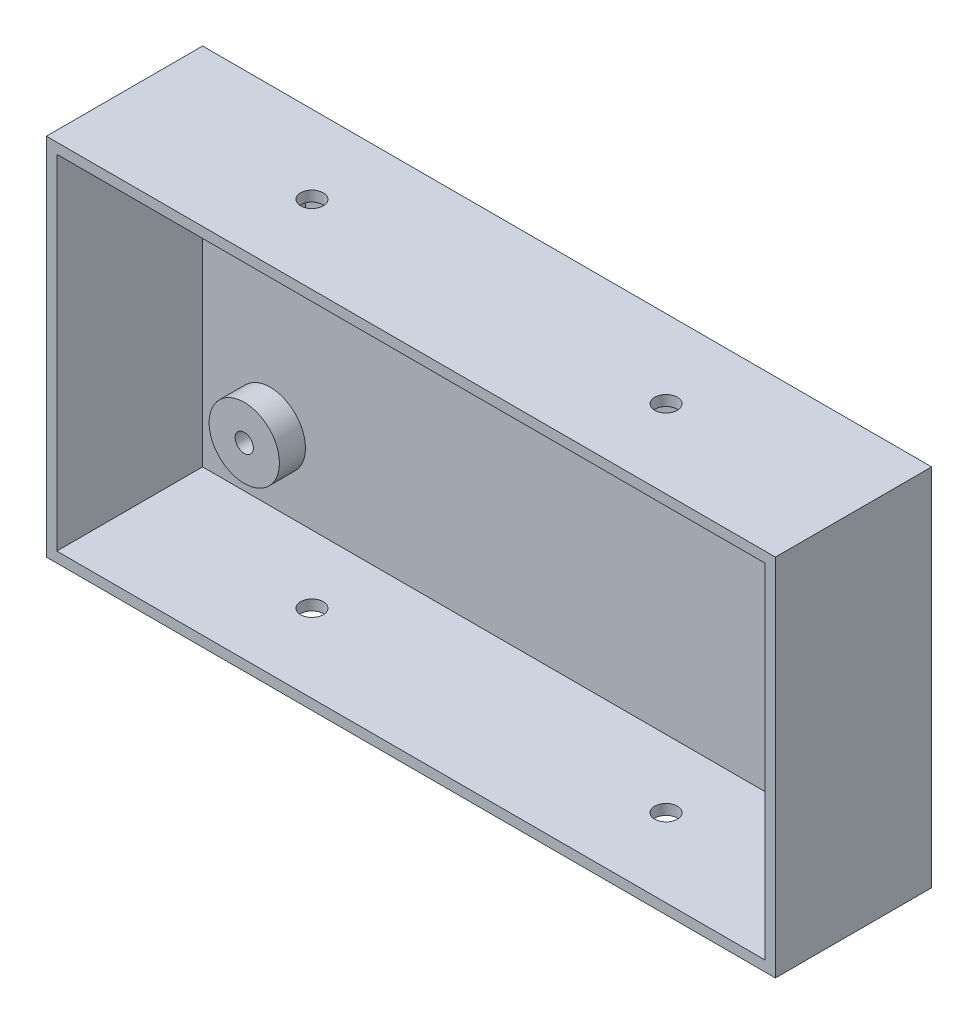
ISO-10303-21;
HEADER;
FILE_DESCRIPTION(('STEP AP214'),'2;1');
FILE_NAME('part.step','',(''),(''),'','','');
FILE_SCHEMA(('AUTOMOTIVE_DESIGN { 1 0 10303 214 1 1 1 1 }'));
ENDSEC;
DATA;
#1=APPLICATION_CONTEXT('core data for automotive mechanical design processes');
#2=APPLICATION_PROTOCOL_DEFINITION('international standard','automotive_design',2000,#1);
#3=PRODUCT_CONTEXT('',#1,'mechanical');
#4=PRODUCT('Part','Part','',(#3));
#5=PRODUCT_RELATED_PRODUCT_CATEGORY('part','',(#4));
#6=PRODUCT_DEFINITION_FORMATION('','',#4);
#7=PRODUCT_DEFINITION_CONTEXT('part definition',#1,'design');
#8=PRODUCT_DEFINITION('design','',#6,#7);
#9=PRODUCT_DEFINITION_SHAPE('','',#8);
#10=(LENGTH_UNIT() NAMED_UNIT(*) SI_UNIT(.MILLI.,.METRE.));
#11=(NAMED_UNIT(*) PLANE_ANGLE_UNIT() SI_UNIT($,.RADIAN.));
#12=(NAMED_UNIT(*) SI_UNIT($,.STERADIAN.) SOLID_ANGLE_UNIT());
#13=UNCERTAINTY_MEASURE_WITH_UNIT(LENGTH_MEASURE(1.E-05),#10,'distance_accuracy_value','');
#14=(GEOMETRIC_REPRESENTATION_CONTEXT(3) GLOBAL_UNCERTAINTY_ASSIGNED_CONTEXT((#13)) GLOBAL_UNIT_ASSIGNED_CONTEXT((#10,
#11,#12)) REPRESENTATION_CONTEXT('',''));
#15=CARTESIAN_POINT('',(0.,0.,0.));
#16=DIRECTION('',(0.,0.,1.));
#17=DIRECTION('',(1.,0.,0.));
#18=AXIS2_PLACEMENT_3D('',#15,#16,#17);
#19=CARTESIAN_POINT('',(0.,35.,30.));
#20=DIRECTION('',(0.,-1.,0.));
#21=DIRECTION('',(1.,0.,0.));
#22=AXIS2_PLACEMENT_3D('',#19,#20,#21);
#23=PLANE('',#22);
#24=DIRECTION('',(-1.,0.,0.));
#25=VECTOR('',#24,1.);
#26=CARTESIAN_POINT('',(0.,35.,0.));
#27=LINE('',#26,#25);
#28=CARTESIAN_POINT('',(70.,35.,0.));
#29=VERTEX_POINT('',#28);
#30=CARTESIAN_POINT('',(-70.,35.,0.));
#31=VERTEX_POINT('',#30);
#32=EDGE_CURVE('E165',#29,#31,#27,.T.);
#33=ORIENTED_EDGE('',*,*,#32,.T.);
#34=DIRECTION('',(0.,0.,-1.));
#35=VECTOR('',#34,1.);
#36=CARTESIAN_POINT('',(-70.,35.,30.));
#37=LINE('',#36,#35);
#38=CARTESIAN_POINT('',(-70.,35.,30.));
#39=VERTEX_POINT('',#38);
#40=EDGE_CURVE('E204',#39,#31,#37,.T.);
#41=ORIENTED_EDGE('',*,*,#40,.F.);
#42=DIRECTION('',(-1.,0.,0.));
#43=VECTOR('',#42,1.);
#44=CARTESIAN_POINT('',(0.,35.,30.));
#45=LINE('',#44,#43);
#46=CARTESIAN_POINT('',(70.,35.,30.));
#47=VERTEX_POINT('',#46);
#48=EDGE_CURVE('E173',#47,#39,#45,.T.);
#49=ORIENTED_EDGE('',*,*,#48,.F.);
#50=DIRECTION('',(0.,0.,-1.));
#51=VECTOR('',#50,1.);
#52=CARTESIAN_POINT('',(70.,35.,30.));
#53=LINE('',#52,#51);
#54=EDGE_CURVE('E183',#47,#29,#53,.T.);
#55=ORIENTED_EDGE('',*,*,#54,.T.);
#56=EDGE_LOOP('',(#33,#41,#49,#55));
#57=FACE_BOUND('',#56,.T.);
#58=CARTESIAN_POINT('',(-34.,35.,15.));
#59=DIRECTION('',(0.,-1.,0.));
#60=DIRECTION('',(-1.,0.,0.));
#61=AXIS2_PLACEMENT_3D('',#58,#59,#60);
#62=CIRCLE('',#61,2.175);
#63=CARTESIAN_POINT('',(-36.175,35.,15.));
#64=VERTEX_POINT('',#63);
#65=EDGE_CURVE('E261',#64,#64,#62,.T.);
#66=ORIENTED_EDGE('',*,*,#65,.T.);
#67=EDGE_LOOP('',(#66));
#68=FACE_BOUND('',#67,.T.);
#69=CARTESIAN_POINT('',(34.,35.,15.));
#70=DIRECTION('',(0.,1.,0.));
#71=DIRECTION('',(-1.,0.,0.));
#72=AXIS2_PLACEMENT_3D('',#69,#70,#71);
#73=CIRCLE('',#72,2.175);
#74=CARTESIAN_POINT('',(31.825,35.,15.));
#75=VERTEX_POINT('',#74);
#76=EDGE_CURVE('E264',#75,#75,#73,.T.);
#77=ORIENTED_EDGE('',*,*,#76,.F.);
#78=EDGE_LOOP('',(#77));
#79=FACE_BOUND('',#78,.T.);
#80=ADVANCED_FACE('F16',(#57,#68,#79),#23,.F.);
#81=CARTESIAN_POINT('',(0.,33.,-227.817621135332));
#82=DIRECTION('',(0.,1.,0.));
#83=DIRECTION('',(-1.,0.,0.));
#84=AXIS2_PLACEMENT_3D('',#81,#82,#83);
#85=PLANE('',#84);
#86=DIRECTION('',(1.,0.,0.));
#87=VECTOR('',#86,1.);
#88=CARTESIAN_POINT('',(0.,33.,2.));
#89=LINE('',#88,#87);
#90=CARTESIAN_POINT('',(-68.,33.,2.));
#91=VERTEX_POINT('',#90);
#92=CARTESIAN_POINT('',(68.,33.,2.));
#93=VERTEX_POINT('',#92);
#94=EDGE_CURVE('E127',#91,#93,#89,.T.);
#95=ORIENTED_EDGE('',*,*,#94,.T.);
#96=DIRECTION('',(0.,0.,1.));
#97=VECTOR('',#96,1.);
#98=CARTESIAN_POINT('',(68.,33.,-227.817621135332));
#99=LINE('',#98,#97);
#100=CARTESIAN_POINT('',(68.,33.,30.));
#101=VERTEX_POINT('',#100);
#102=EDGE_CURVE('E135',#93,#101,#99,.T.);
#103=ORIENTED_EDGE('',*,*,#102,.T.);
#104=DIRECTION('',(-1.,0.,0.));
#105=VECTOR('',#104,1.);
#106=CARTESIAN_POINT('',(0.,33.,30.));
#107=LINE('',#106,#105);
#108=CARTESIAN_POINT('',(-68.,33.,30.));
#109=VERTEX_POINT('',#108);
#110=EDGE_CURVE('E131',#101,#109,#107,.T.);
#111=ORIENTED_EDGE('',*,*,#110,.T.);
#112=DIRECTION('',(0.,0.,1.));
#113=VECTOR('',#112,1.);
#114=CARTESIAN_POINT('',(-68.,33.,-227.817621135332));
#115=LINE('',#114,#113);
#116=EDGE_CURVE('E116',#91,#109,#115,.T.);
#117=ORIENTED_EDGE('',*,*,#116,.F.);
#118=EDGE_LOOP('',(#95,#103,#111,#117));
#119=FACE_BOUND('',#118,.T.);
#120=CARTESIAN_POINT('',(-34.,33.,15.));
#121=DIRECTION('',(0.,-1.,0.));
#122=DIRECTION('',(-1.,0.,0.));
#123=AXIS2_PLACEMENT_3D('',#120,#121,#122);
#124=CIRCLE('',#123,2.175);
#125=CARTESIAN_POINT('',(-36.175,33.,15.));
#126=VERTEX_POINT('',#125);
#127=EDGE_CURVE('E268',#126,#126,#124,.T.);
#128=ORIENTED_EDGE('',*,*,#127,.F.);
#129=EDGE_LOOP('',(#128));
#130=FACE_BOUND('',#129,.T.);
#131=CARTESIAN_POINT('',(34.,33.,15.));
#132=DIRECTION('',(0.,1.,0.));
#133=DIRECTION('',(-1.,0.,0.));
#134=AXIS2_PLACEMENT_3D('',#131,#132,#133);
#135=CIRCLE('',#134,2.175);
#136=CARTESIAN_POINT('',(31.825,33.,15.));
#137=VERTEX_POINT('',#136);
#138=EDGE_CURVE('E267',#137,#137,#135,.T.);
#139=ORIENTED_EDGE('',*,*,#138,.T.);
#140=EDGE_LOOP('',(#139));
#141=FACE_BOUND('',#140,.T.);
#142=ADVANCED_FACE('F132',(#119,#130,#141),#85,.F.);
#143=CARTESIAN_POINT('',(0.,-35.,30.));
#144=DIRECTION('',(0.,1.,0.));
#145=DIRECTION('',(-1.,0.,0.));
#146=AXIS2_PLACEMENT_3D('',#143,#144,#145);
#147=PLANE('',#146);
#148=DIRECTION('',(1.,0.,0.));
#149=VECTOR('',#148,1.);
#150=CARTESIAN_POINT('',(0.,-35.,0.));
#151=LINE('',#150,#149);
#152=CARTESIAN_POINT('',(-70.,-35.,0.));
#153=VERTEX_POINT('',#152);
#154=CARTESIAN_POINT('',(70.,-35.,0.));
#155=VERTEX_POINT('',#154);
#156=EDGE_CURVE('E190',#153,#155,#151,.T.);
#157=ORIENTED_EDGE('',*,*,#156,.T.);
#158=DIRECTION('',(0.,0.,-1.));
#159=VECTOR('',#158,1.);
#160=CARTESIAN_POINT('',(70.,-35.,30.));
#161=LINE('',#160,#159);
#162=CARTESIAN_POINT('',(70.,-35.,30.));
#163=VERTEX_POINT('',#162);
#164=EDGE_CURVE('E197',#163,#155,#161,.T.);
#165=ORIENTED_EDGE('',*,*,#164,.F.);
#166=DIRECTION('',(1.,0.,0.));
#167=VECTOR('',#166,1.);
#168=CARTESIAN_POINT('',(0.,-35.,30.));
#169=LINE('',#168,#167);
#170=CARTESIAN_POINT('',(-70.,-35.,30.));
#171=VERTEX_POINT('',#170);
#172=EDGE_CURVE('E178',#171,#163,#169,.T.);
#173=ORIENTED_EDGE('',*,*,#172,.F.);
#174=DIRECTION('',(0.,0.,-1.));
#175=VECTOR('',#174,1.);
#176=CARTESIAN_POINT('',(-70.,-35.,30.));
#177=LINE('',#176,#175);
#178=EDGE_CURVE('E200',#171,#153,#177,.T.);
#179=ORIENTED_EDGE('',*,*,#178,.T.);
#180=EDGE_LOOP('',(#157,#165,#173,#179));
#181=FACE_BOUND('',#180,.T.);
#182=CARTESIAN_POINT('',(34.,-35.,15.));
#183=DIRECTION('',(0.,1.,0.));
#184=DIRECTION('',(1.,0.,0.));
#185=AXIS2_PLACEMENT_3D('',#182,#183,#184);
#186=CIRCLE('',#185,2.175);
#187=CARTESIAN_POINT('',(36.175,-35.,15.));
#188=VERTEX_POINT('',#187);
#189=EDGE_CURVE('E274',#188,#188,#186,.T.);
#190=ORIENTED_EDGE('',*,*,#189,.T.);
#191=EDGE_LOOP('',(#190));
#192=FACE_BOUND('',#191,.T.);
#193=CARTESIAN_POINT('',(-34.,-35.,15.));
#194=DIRECTION('',(0.,-1.,0.));
#195=DIRECTION('',(1.,0.,0.));
#196=AXIS2_PLACEMENT_3D('',#193,#194,#195);
#197=CIRCLE('',#196,2.175);
#198=CARTESIAN_POINT('',(-31.825,-35.,15.));
#199=VERTEX_POINT('',#198);
#200=EDGE_CURVE('E287',#199,#199,#197,.T.);
#201=ORIENTED_EDGE('',*,*,#200,.F.);
#202=EDGE_LOOP('',(#201));
#203=FACE_BOUND('',#202,.T.);
#204=ADVANCED_FACE('F235',(#181,#192,#203),#147,.F.);
#205=CARTESIAN_POINT('',(0.,-33.,-227.817621135332));
#206=DIRECTION('',(0.,-1.,0.));
#207=DIRECTION('',(1.,0.,0.));
#208=AXIS2_PLACEMENT_3D('',#205,#206,#207);
#209=PLANE('',#208);
#210=DIRECTION('',(-1.,0.,0.));
#211=VECTOR('',#210,1.);
#212=CARTESIAN_POINT('',(0.,-33.,2.));
#213=LINE('',#212,#211);
#214=CARTESIAN_POINT('',(68.,-33.,2.));
#215=VERTEX_POINT('',#214);
#216=CARTESIAN_POINT('',(-68.,-33.,2.));
#217=VERTEX_POINT('',#216);
#218=EDGE_CURVE('E166',#215,#217,#213,.T.);
#219=ORIENTED_EDGE('',*,*,#218,.T.);
#220=DIRECTION('',(0.,0.,1.));
#221=VECTOR('',#220,1.);
#222=CARTESIAN_POINT('',(-68.,-33.,-227.817621135332));
#223=LINE('',#222,#221);
#224=CARTESIAN_POINT('',(-68.,-33.,30.));
#225=VERTEX_POINT('',#224);
#226=EDGE_CURVE('E128',#217,#225,#223,.T.);
#227=ORIENTED_EDGE('',*,*,#226,.T.);
#228=DIRECTION('',(1.,0.,0.));
#229=VECTOR('',#228,1.);
#230=CARTESIAN_POINT('',(0.,-33.,30.));
#231=LINE('',#230,#229);
#232=CARTESIAN_POINT('',(68.,-33.,30.));
#233=VERTEX_POINT('',#232);
#234=EDGE_CURVE('E36',#225,#233,#231,.T.);
#235=ORIENTED_EDGE('',*,*,#234,.T.);
#236=DIRECTION('',(0.,0.,1.));
#237=VECTOR('',#236,1.);
#238=CARTESIAN_POINT('',(68.,-33.,-227.817621135332));
#239=LINE('',#238,#237);
#240=EDGE_CURVE('E156',#215,#233,#239,.T.);
#241=ORIENTED_EDGE('',*,*,#240,.F.);
#242=EDGE_LOOP('',(#219,#227,#235,#241));
#243=FACE_BOUND('',#242,.T.);
#244=CARTESIAN_POINT('',(34.,-33.,15.));
#245=DIRECTION('',(0.,1.,0.));
#246=DIRECTION('',(1.,0.,0.));
#247=AXIS2_PLACEMENT_3D('',#244,#245,#246);
#248=CIRCLE('',#247,2.175);
#249=CARTESIAN_POINT('',(36.175,-33.,15.));
#250=VERTEX_POINT('',#249);
#251=EDGE_CURVE('E291',#250,#250,#248,.T.);
#252=ORIENTED_EDGE('',*,*,#251,.F.);
#253=EDGE_LOOP('',(#252));
#254=FACE_BOUND('',#253,.T.);
#255=CARTESIAN_POINT('',(-34.,-33.,15.));
#256=DIRECTION('',(0.,-1.,0.));
#257=DIRECTION('',(1.,0.,0.));
#258=AXIS2_PLACEMENT_3D('',#255,#256,#257);
#259=CIRCLE('',#258,2.175);
#260=CARTESIAN_POINT('',(-31.825,-33.,15.));
#261=VERTEX_POINT('',#260);
#262=EDGE_CURVE('E282',#261,#261,#259,.T.);
#263=ORIENTED_EDGE('',*,*,#262,.T.);
#264=EDGE_LOOP('',(#263));
#265=FACE_BOUND('',#264,.T.);
#266=ADVANCED_FACE('F224',(#243,#254,#265),#209,.F.);
#267=CARTESIAN_POINT('',(0.,0.,2.));
#268=DIRECTION('',(0.,0.,1.));
#269=DIRECTION('',(1.,0.,0.));
#270=AXIS2_PLACEMENT_3D('',#267,#268,#269);
#271=PLANE('',#270);
#272=CARTESIAN_POINT('',(55.,-20.,2.));
#273=DIRECTION('',(0.,0.,1.));
#274=DIRECTION('',(1.,0.,0.));
#275=AXIS2_PLACEMENT_3D('',#272,#273,#274);
#276=CIRCLE('',#275,6.75);
#277=CARTESIAN_POINT('',(61.75,-20.,2.));
#278=VERTEX_POINT('',#277);
#279=EDGE_CURVE('E286',#278,#278,#276,.T.);
#280=ORIENTED_EDGE('',*,*,#279,.F.);
#281=EDGE_LOOP('',(#280));
#282=FACE_BOUND('',#281,.T.);
#283=CARTESIAN_POINT('',(55.,20.,2.));
#284=DIRECTION('',(0.,0.,1.));
#285=DIRECTION('',(1.,0.,0.));
#286=AXIS2_PLACEMENT_3D('',#283,#284,#285);
#287=CIRCLE('',#286,6.75);
#288=CARTESIAN_POINT('',(61.75,20.,2.));
#289=VERTEX_POINT('',#288);
#290=EDGE_CURVE('E10',#289,#289,#287,.T.);
#291=ORIENTED_EDGE('',*,*,#290,.F.);
#292=EDGE_LOOP('',(#291));
#293=FACE_BOUND('',#292,.T.);
#294=ORIENTED_EDGE('',*,*,#94,.F.);
#295=DIRECTION('',(0.,1.,0.));
#296=VECTOR('',#295,1.);
#297=CARTESIAN_POINT('',(-68.,0.,2.));
#298=LINE('',#297,#296);
#299=EDGE_CURVE('E122',#217,#91,#298,.T.);
#300=ORIENTED_EDGE('',*,*,#299,.F.);
#301=ORIENTED_EDGE('',*,*,#218,.F.);
#302=DIRECTION('',(0.,-1.,0.));
#303=VECTOR('',#302,1.);
#304=CARTESIAN_POINT('',(68.,0.,2.));
#305=LINE('',#304,#303);
#306=EDGE_CURVE('E161',#93,#215,#305,.T.);
#307=ORIENTED_EDGE('',*,*,#306,.F.);
#308=EDGE_LOOP('',(#294,#300,#301,#307));
#309=FACE_BOUND('',#308,.T.);
#310=CARTESIAN_POINT('',(-55.,20.,2.));
#311=DIRECTION('',(0.,0.,1.));
#312=DIRECTION('',(1.,0.,0.));
#313=AXIS2_PLACEMENT_3D('',#310,#311,#312);
#314=CIRCLE('',#313,6.75);
#315=CARTESIAN_POINT('',(-48.25,20.,2.));
#316=VERTEX_POINT('',#315);
#317=EDGE_CURVE('E333',#316,#316,#314,.T.);
#318=ORIENTED_EDGE('',*,*,#317,.F.);
#319=EDGE_LOOP('',(#318));
#320=FACE_BOUND('',#319,.T.);
#321=CARTESIAN_POINT('',(-55.,-20.,2.));
#322=DIRECTION('',(0.,0.,1.));
#323=DIRECTION('',(1.,0.,0.));
#324=AXIS2_PLACEMENT_3D('',#321,#322,#323);
#325=CIRCLE('',#324,6.75);
#326=CARTESIAN_POINT('',(-48.25,-20.,2.));
#327=VERTEX_POINT('',#326);
#328=EDGE_CURVE('E24',#327,#327,#325,.T.);
#329=ORIENTED_EDGE('',*,*,#328,.F.);
#330=EDGE_LOOP('',(#329));
#331=FACE_BOUND('',#330,.T.);
#332=ADVANCED_FACE('F221',(#282,#293,#309,#320,#331),#271,.T.);
#333=CARTESIAN_POINT('',(-70.,0.,30.));
#334=DIRECTION('',(1.,0.,0.));
#335=DIRECTION('',(0.,0.,-1.));
#336=AXIS2_PLACEMENT_3D('',#333,#334,#335);
#337=PLANE('',#336);
#338=DIRECTION('',(0.,-1.,0.));
#339=VECTOR('',#338,1.);
#340=CARTESIAN_POINT('',(-70.,0.,0.));
#341=LINE('',#340,#339);
#342=EDGE_CURVE('E187',#31,#153,#341,.T.);
#343=ORIENTED_EDGE('',*,*,#342,.T.);
#344=ORIENTED_EDGE('',*,*,#178,.F.);
#345=DIRECTION('',(0.,-1.,0.));
#346=VECTOR('',#345,1.);
#347=CARTESIAN_POINT('',(-70.,0.,30.));
#348=LINE('',#347,#346);
#349=EDGE_CURVE('E85',#39,#171,#348,.T.);
#350=ORIENTED_EDGE('',*,*,#349,.F.);
#351=ORIENTED_EDGE('',*,*,#40,.T.);
#352=EDGE_LOOP('',(#343,#344,#350,#351));
#353=FACE_BOUND('',#352,.T.);
#354=ADVANCED_FACE('F223',(#353),#337,.F.);
#355=CARTESIAN_POINT('',(70.,0.,30.));
#356=DIRECTION('',(-1.,0.,0.));
#357=DIRECTION('',(0.,0.,1.));
#358=AXIS2_PLACEMENT_3D('',#355,#356,#357);
#359=PLANE('',#358);
#360=DIRECTION('',(0.,1.,0.));
#361=VECTOR('',#360,1.);
#362=CARTESIAN_POINT('',(70.,0.,0.));
#363=LINE('',#362,#361);
#364=EDGE_CURVE('E75',#155,#29,#363,.T.);
#365=ORIENTED_EDGE('',*,*,#364,.T.);
#366=ORIENTED_EDGE('',*,*,#54,.F.);
#367=DIRECTION('',(0.,1.,0.));
#368=VECTOR('',#367,1.);
#369=CARTESIAN_POINT('',(70.,0.,30.));
#370=LINE('',#369,#368);
#371=EDGE_CURVE('E49',#163,#47,#370,.T.);
#372=ORIENTED_EDGE('',*,*,#371,.F.);
#373=ORIENTED_EDGE('',*,*,#164,.T.);
#374=EDGE_LOOP('',(#365,#366,#372,#373));
#375=FACE_BOUND('',#374,.T.);
#376=ADVANCED_FACE('F234',(#375),#359,.F.);
#377=CARTESIAN_POINT('',(0.,0.,30.));
#378=DIRECTION('',(0.,0.,1.));
#379=DIRECTION('',(1.,0.,0.));
#380=AXIS2_PLACEMENT_3D('',#377,#378,#379);
#381=PLANE('',#380);
#382=ORIENTED_EDGE('',*,*,#110,.F.);
#383=DIRECTION('',(0.,1.,0.));
#384=VECTOR('',#383,1.);
#385=CARTESIAN_POINT('',(68.,0.,30.));
#386=LINE('',#385,#384);
#387=EDGE_CURVE('E149',#233,#101,#386,.T.);
#388=ORIENTED_EDGE('',*,*,#387,.F.);
#389=ORIENTED_EDGE('',*,*,#234,.F.);
#390=DIRECTION('',(0.,-1.,0.));
#391=VECTOR('',#390,1.);
#392=CARTESIAN_POINT('',(-68.,0.,30.));
#393=LINE('',#392,#391);
#394=EDGE_CURVE('E121',#109,#225,#393,.T.);
#395=ORIENTED_EDGE('',*,*,#394,.F.);
#396=EDGE_LOOP('',(#382,#388,#389,#395));
#397=FACE_BOUND('',#396,.T.);
#398=ORIENTED_EDGE('',*,*,#48,.T.);
#399=ORIENTED_EDGE('',*,*,#349,.T.);
#400=ORIENTED_EDGE('',*,*,#172,.T.);
#401=ORIENTED_EDGE('',*,*,#371,.T.);
#402=EDGE_LOOP('',(#398,#399,#400,#401));
#403=FACE_BOUND('',#402,.T.);
#404=ADVANCED_FACE('F142',(#397,#403),#381,.T.);
#405=CARTESIAN_POINT('',(0.,0.,0.));
#406=DIRECTION('',(0.,0.,1.));
#407=DIRECTION('',(1.,0.,0.));
#408=AXIS2_PLACEMENT_3D('',#405,#406,#407);
#409=PLANE('',#408);
#410=ORIENTED_EDGE('',*,*,#32,.F.);
#411=ORIENTED_EDGE('',*,*,#364,.F.);
#412=ORIENTED_EDGE('',*,*,#156,.F.);
#413=ORIENTED_EDGE('',*,*,#342,.F.);
#414=EDGE_LOOP('',(#410,#411,#412,#413));
#415=FACE_BOUND('',#414,.T.);
#416=ADVANCED_FACE('F364',(#415),#409,.F.);
#417=CARTESIAN_POINT('',(-68.,0.,-227.817621135332));
#418=DIRECTION('',(-1.,0.,0.));
#419=DIRECTION('',(0.,0.,1.));
#420=AXIS2_PLACEMENT_3D('',#417,#418,#419);
#421=PLANE('',#420);
#422=ORIENTED_EDGE('',*,*,#299,.T.);
#423=ORIENTED_EDGE('',*,*,#116,.T.);
#424=ORIENTED_EDGE('',*,*,#394,.T.);
#425=ORIENTED_EDGE('',*,*,#226,.F.);
#426=EDGE_LOOP('',(#422,#423,#424,#425));
#427=FACE_BOUND('',#426,.T.);
#428=ADVANCED_FACE('F118',(#427),#421,.F.);
#429=CARTESIAN_POINT('',(68.,0.,-227.817621135332));
#430=DIRECTION('',(1.,0.,0.));
#431=DIRECTION('',(0.,0.,-1.));
#432=AXIS2_PLACEMENT_3D('',#429,#430,#431);
#433=PLANE('',#432);
#434=ORIENTED_EDGE('',*,*,#306,.T.);
#435=ORIENTED_EDGE('',*,*,#240,.T.);
#436=ORIENTED_EDGE('',*,*,#387,.T.);
#437=ORIENTED_EDGE('',*,*,#102,.F.);
#438=EDGE_LOOP('',(#434,#435,#436,#437));
#439=FACE_BOUND('',#438,.T.);
#440=ADVANCED_FACE('F357',(#439),#433,.F.);
#441=CARTESIAN_POINT('',(-55.,20.,7.));
#442=DIRECTION('',(0.,0.,-1.));
#443=DIRECTION('',(-1.,0.,0.));
#444=AXIS2_PLACEMENT_3D('',#441,#442,#443);
#445=CYLINDRICAL_SURFACE('',#444,1.75);
#446=CARTESIAN_POINT('',(-55.,20.,7.));
#447=DIRECTION('',(0.,0.,1.));
#448=DIRECTION('',(1.,0.,0.));
#449=AXIS2_PLACEMENT_3D('',#446,#447,#448);
#450=CIRCLE('',#449,1.75);
#451=CARTESIAN_POINT('',(-53.25,20.,7.));
#452=VERTEX_POINT('',#451);
#453=EDGE_CURVE('E140',#452,#452,#450,.T.);
#454=ORIENTED_EDGE('',*,*,#453,.T.);
#455=EDGE_LOOP('',(#454));
#456=FACE_BOUND('',#455,.T.);
#457=CARTESIAN_POINT('',(-55.,20.,2.));
#458=DIRECTION('',(0.,0.,1.));
#459=DIRECTION('',(1.,0.,0.));
#460=AXIS2_PLACEMENT_3D('',#457,#458,#459);
#461=CIRCLE('',#460,1.75);
#462=CARTESIAN_POINT('',(-53.25,20.,2.));
#463=VERTEX_POINT('',#462);
#464=EDGE_CURVE('E206',#463,#463,#461,.F.);
#465=ORIENTED_EDGE('',*,*,#464,.T.);
#466=EDGE_LOOP('',(#465));
#467=FACE_BOUND('',#466,.T.);
#468=ADVANCED_FACE('F348',(#456,#467),#445,.F.);
#469=CARTESIAN_POINT('',(-55.,20.,7.));
#470=DIRECTION('',(0.,0.,-1.));
#471=DIRECTION('',(-1.,0.,0.));
#472=AXIS2_PLACEMENT_3D('',#469,#470,#471);
#473=CYLINDRICAL_SURFACE('',#472,6.75);
#474=CARTESIAN_POINT('',(-55.,20.,7.));
#475=DIRECTION('',(0.,0.,1.));
#476=DIRECTION('',(1.,0.,0.));
#477=AXIS2_PLACEMENT_3D('',#474,#475,#476);
#478=CIRCLE('',#477,6.75);
#479=CARTESIAN_POINT('',(-48.25,20.,7.));
#480=VERTEX_POINT('',#479);
#481=EDGE_CURVE('E334',#480,#480,#478,.T.);
#482=ORIENTED_EDGE('',*,*,#481,.F.);
#483=EDGE_LOOP('',(#482));
#484=FACE_BOUND('',#483,.T.);
#485=ORIENTED_EDGE('',*,*,#317,.T.);
#486=EDGE_LOOP('',(#485));
#487=FACE_BOUND('',#486,.T.);
#488=ADVANCED_FACE('F345',(#484,#487),#473,.T.);
#489=CARTESIAN_POINT('',(0.,0.,7.));
#490=DIRECTION('',(0.,0.,1.));
#491=DIRECTION('',(1.,0.,0.));
#492=AXIS2_PLACEMENT_3D('',#489,#490,#491);
#493=PLANE('',#492);
#494=ORIENTED_EDGE('',*,*,#453,.F.);
#495=EDGE_LOOP('',(#494));
#496=FACE_BOUND('',#495,.T.);
#497=ORIENTED_EDGE('',*,*,#481,.T.);
#498=EDGE_LOOP('',(#497));
#499=FACE_BOUND('',#498,.T.);
#500=ADVANCED_FACE('F247',(#496,#499),#493,.T.);
#501=ORIENTED_EDGE('',*,*,#464,.F.);
#502=EDGE_LOOP('',(#501));
#503=FACE_BOUND('',#502,.T.);
#504=ADVANCED_FACE('F228',(#503),#271,.T.);
#505=CARTESIAN_POINT('',(-55.,-20.,7.));
#506=DIRECTION('',(0.,0.,-1.));
#507=DIRECTION('',(-1.,0.,0.));
#508=AXIS2_PLACEMENT_3D('',#505,#506,#507);
#509=CYLINDRICAL_SURFACE('',#508,6.75);
#510=CARTESIAN_POINT('',(-55.,-20.,7.));
#511=DIRECTION('',(0.,0.,-1.));
#512=DIRECTION('',(1.,0.,0.));
#513=AXIS2_PLACEMENT_3D('',#510,#511,#512);
#514=CIRCLE('',#513,6.75);
#515=CARTESIAN_POINT('',(-48.25,-20.,7.));
#516=VERTEX_POINT('',#515);
#517=EDGE_CURVE('E322',#516,#516,#514,.T.);
#518=ORIENTED_EDGE('',*,*,#517,.T.);
#519=EDGE_LOOP('',(#518));
#520=FACE_BOUND('',#519,.T.);
#521=ORIENTED_EDGE('',*,*,#328,.T.);
#522=EDGE_LOOP('',(#521));
#523=FACE_BOUND('',#522,.T.);
#524=ADVANCED_FACE('F219',(#520,#523),#509,.T.);
#525=CARTESIAN_POINT('',(-55.,-20.,7.));
#526=DIRECTION('',(0.,0.,-1.));
#527=DIRECTION('',(-1.,0.,0.));
#528=AXIS2_PLACEMENT_3D('',#525,#526,#527);
#529=CYLINDRICAL_SURFACE('',#528,1.75);
#530=CARTESIAN_POINT('',(-55.,-20.,7.));
#531=DIRECTION('',(0.,0.,1.));
#532=DIRECTION('',(1.,0.,0.));
#533=AXIS2_PLACEMENT_3D('',#530,#531,#532);
#534=CIRCLE('',#533,1.75);
#535=CARTESIAN_POINT('',(-53.25,-20.,7.));
#536=VERTEX_POINT('',#535);
#537=EDGE_CURVE('E329',#536,#536,#534,.T.);
#538=ORIENTED_EDGE('',*,*,#537,.T.);
#539=EDGE_LOOP('',(#538));
#540=FACE_BOUND('',#539,.T.);
#541=CARTESIAN_POINT('',(-55.,-20.,2.));
#542=DIRECTION('',(0.,0.,1.));
#543=DIRECTION('',(1.,0.,0.));
#544=AXIS2_PLACEMENT_3D('',#541,#542,#543);
#545=CIRCLE('',#544,1.75);
#546=CARTESIAN_POINT('',(-53.25,-20.,2.));
#547=VERTEX_POINT('',#546);
#548=EDGE_CURVE('E210',#547,#547,#545,.F.);
#549=ORIENTED_EDGE('',*,*,#548,.T.);
#550=EDGE_LOOP('',(#549));
#551=FACE_BOUND('',#550,.T.);
#552=ADVANCED_FACE('F432',(#540,#551),#529,.F.);
#553=CARTESIAN_POINT('',(0.,0.,7.));
#554=DIRECTION('',(0.,0.,1.));
#555=DIRECTION('',(1.,0.,0.));
#556=AXIS2_PLACEMENT_3D('',#553,#554,#555);
#557=PLANE('',#556);
#558=ORIENTED_EDGE('',*,*,#517,.F.);
#559=EDGE_LOOP('',(#558));
#560=FACE_BOUND('',#559,.T.);
#561=ORIENTED_EDGE('',*,*,#537,.F.);
#562=EDGE_LOOP('',(#561));
#563=FACE_BOUND('',#562,.T.);
#564=ADVANCED_FACE('F429',(#560,#563),#557,.T.);
#565=ORIENTED_EDGE('',*,*,#548,.F.);
#566=EDGE_LOOP('',(#565));
#567=FACE_BOUND('',#566,.T.);
#568=ADVANCED_FACE('F249',(#567),#271,.T.);
#569=CARTESIAN_POINT('',(55.,20.,7.));
#570=DIRECTION('',(0.,0.,-1.));
#571=DIRECTION('',(-1.,0.,0.));
#572=AXIS2_PLACEMENT_3D('',#569,#570,#571);
#573=CYLINDRICAL_SURFACE('',#572,6.75);
#574=CARTESIAN_POINT('',(55.,20.,7.));
#575=DIRECTION('',(0.,0.,-1.));
#576=DIRECTION('',(1.,0.,0.));
#577=AXIS2_PLACEMENT_3D('',#574,#575,#576);
#578=CIRCLE('',#577,6.75);
#579=CARTESIAN_POINT('',(61.75,20.,7.));
#580=VERTEX_POINT('',#579);
#581=EDGE_CURVE('E318',#580,#580,#578,.T.);
#582=ORIENTED_EDGE('',*,*,#581,.T.);
#583=EDGE_LOOP('',(#582));
#584=FACE_BOUND('',#583,.T.);
#585=ORIENTED_EDGE('',*,*,#290,.T.);
#586=EDGE_LOOP('',(#585));
#587=FACE_BOUND('',#586,.T.);
#588=ADVANCED_FACE('F422',(#584,#587),#573,.T.);
#589=CARTESIAN_POINT('',(55.,20.,7.));
#590=DIRECTION('',(0.,0.,-1.));
#591=DIRECTION('',(-1.,0.,0.));
#592=AXIS2_PLACEMENT_3D('',#589,#590,#591);
#593=CYLINDRICAL_SURFACE('',#592,1.75);
#594=CARTESIAN_POINT('',(55.,20.,7.));
#595=DIRECTION('',(0.,0.,-1.));
#596=DIRECTION('',(1.,0.,0.));
#597=AXIS2_PLACEMENT_3D('',#594,#595,#596);
#598=CIRCLE('',#597,1.75);
#599=CARTESIAN_POINT('',(56.75,20.,7.));
#600=VERTEX_POINT('',#599);
#601=EDGE_CURVE('E314',#600,#600,#598,.T.);
#602=ORIENTED_EDGE('',*,*,#601,.F.);
#603=EDGE_LOOP('',(#602));
#604=FACE_BOUND('',#603,.T.);
#605=CARTESIAN_POINT('',(55.,20.,2.));
#606=DIRECTION('',(0.,0.,-1.));
#607=DIRECTION('',(1.,0.,0.));
#608=AXIS2_PLACEMENT_3D('',#605,#606,#607);
#609=CIRCLE('',#608,1.75);
#610=CARTESIAN_POINT('',(56.75,20.,2.));
#611=VERTEX_POINT('',#610);
#612=EDGE_CURVE('E307',#611,#611,#609,.T.);
#613=ORIENTED_EDGE('',*,*,#612,.T.);
#614=EDGE_LOOP('',(#613));
#615=FACE_BOUND('',#614,.T.);
#616=ADVANCED_FACE('F420',(#604,#615),#593,.F.);
#617=CARTESIAN_POINT('',(0.,0.,7.));
#618=DIRECTION('',(0.,0.,1.));
#619=DIRECTION('',(1.,0.,0.));
#620=AXIS2_PLACEMENT_3D('',#617,#618,#619);
#621=PLANE('',#620);
#622=ORIENTED_EDGE('',*,*,#581,.F.);
#623=EDGE_LOOP('',(#622));
#624=FACE_BOUND('',#623,.T.);
#625=ORIENTED_EDGE('',*,*,#601,.T.);
#626=EDGE_LOOP('',(#625));
#627=FACE_BOUND('',#626,.T.);
#628=ADVANCED_FACE('F417',(#624,#627),#621,.T.);
#629=ORIENTED_EDGE('',*,*,#612,.F.);
#630=EDGE_LOOP('',(#629));
#631=FACE_BOUND('',#630,.T.);
#632=ADVANCED_FACE('F245',(#631),#271,.T.);
#633=CARTESIAN_POINT('',(55.,-20.,7.));
#634=DIRECTION('',(0.,0.,-1.));
#635=DIRECTION('',(-1.,0.,0.));
#636=AXIS2_PLACEMENT_3D('',#633,#634,#635);
#637=CYLINDRICAL_SURFACE('',#636,1.75);
#638=CARTESIAN_POINT('',(55.,-20.,7.));
#639=DIRECTION('',(0.,0.,-1.));
#640=DIRECTION('',(1.,0.,0.));
#641=AXIS2_PLACEMENT_3D('',#638,#639,#640);
#642=CIRCLE('',#641,1.75);
#643=CARTESIAN_POINT('',(56.75,-20.,7.));
#644=VERTEX_POINT('',#643);
#645=EDGE_CURVE('E302',#644,#644,#642,.T.);
#646=ORIENTED_EDGE('',*,*,#645,.F.);
#647=EDGE_LOOP('',(#646));
#648=FACE_BOUND('',#647,.T.);
#649=CARTESIAN_POINT('',(55.,-20.,2.));
#650=DIRECTION('',(0.,0.,-1.));
#651=DIRECTION('',(1.,0.,0.));
#652=AXIS2_PLACEMENT_3D('',#649,#650,#651);
#653=CIRCLE('',#652,1.75);
#654=CARTESIAN_POINT('',(56.75,-20.,2.));
#655=VERTEX_POINT('',#654);
#656=EDGE_CURVE('E303',#655,#655,#653,.T.);
#657=ORIENTED_EDGE('',*,*,#656,.T.);
#658=EDGE_LOOP('',(#657));
#659=FACE_BOUND('',#658,.T.);
#660=ADVANCED_FACE('F410',(#648,#659),#637,.F.);
#661=CARTESIAN_POINT('',(55.,-20.,7.));
#662=DIRECTION('',(0.,0.,-1.));
#663=DIRECTION('',(-1.,0.,0.));
#664=AXIS2_PLACEMENT_3D('',#661,#662,#663);
#665=CYLINDRICAL_SURFACE('',#664,6.75);
#666=CARTESIAN_POINT('',(55.,-20.,7.));
#667=DIRECTION('',(0.,0.,1.));
#668=DIRECTION('',(1.,0.,0.));
#669=AXIS2_PLACEMENT_3D('',#666,#667,#668);
#670=CIRCLE('',#669,6.75);
#671=CARTESIAN_POINT('',(61.75,-20.,7.));
#672=VERTEX_POINT('',#671);
#673=EDGE_CURVE('E298',#672,#672,#670,.T.);
#674=ORIENTED_EDGE('',*,*,#673,.F.);
#675=EDGE_LOOP('',(#674));
#676=FACE_BOUND('',#675,.T.);
#677=ORIENTED_EDGE('',*,*,#279,.T.);
#678=EDGE_LOOP('',(#677));
#679=FACE_BOUND('',#678,.T.);
#680=ADVANCED_FACE('F408',(#676,#679),#665,.T.);
#681=CARTESIAN_POINT('',(0.,0.,7.));
#682=DIRECTION('',(0.,0.,1.));
#683=DIRECTION('',(1.,0.,0.));
#684=AXIS2_PLACEMENT_3D('',#681,#682,#683);
#685=PLANE('',#684);
#686=ORIENTED_EDGE('',*,*,#645,.T.);
#687=EDGE_LOOP('',(#686));
#688=FACE_BOUND('',#687,.T.);
#689=ORIENTED_EDGE('',*,*,#673,.T.);
#690=EDGE_LOOP('',(#689));
#691=FACE_BOUND('',#690,.T.);
#692=ADVANCED_FACE('F243',(#688,#691),#685,.T.);
#693=ORIENTED_EDGE('',*,*,#656,.F.);
#694=EDGE_LOOP('',(#693));
#695=FACE_BOUND('',#694,.T.);
#696=ADVANCED_FACE('F227',(#695),#271,.T.);
#697=CARTESIAN_POINT('',(34.,-33.,15.));
#698=DIRECTION('',(0.,-1.,0.));
#699=DIRECTION('',(1.,0.,0.));
#700=AXIS2_PLACEMENT_3D('',#697,#698,#699);
#701=CYLINDRICAL_SURFACE('',#700,2.175);
#702=ORIENTED_EDGE('',*,*,#251,.T.);
#703=EDGE_LOOP('',(#702));
#704=FACE_BOUND('',#703,.T.);
#705=ORIENTED_EDGE('',*,*,#189,.F.);
#706=EDGE_LOOP('',(#705));
#707=FACE_BOUND('',#706,.T.);
#708=ADVANCED_FACE('F242',(#704,#707),#701,.F.);
#709=CARTESIAN_POINT('',(-34.,-33.,15.));
#710=DIRECTION('',(0.,-1.,0.));
#711=DIRECTION('',(1.,0.,0.));
#712=AXIS2_PLACEMENT_3D('',#709,#710,#711);
#713=CYLINDRICAL_SURFACE('',#712,2.175);
#714=ORIENTED_EDGE('',*,*,#262,.F.);
#715=EDGE_LOOP('',(#714));
#716=FACE_BOUND('',#715,.T.);
#717=ORIENTED_EDGE('',*,*,#200,.T.);
#718=EDGE_LOOP('',(#717));
#719=FACE_BOUND('',#718,.T.);
#720=ADVANCED_FACE('F389',(#716,#719),#713,.F.);
#721=CARTESIAN_POINT('',(-34.,33.,15.));
#722=DIRECTION('',(0.,1.,0.));
#723=DIRECTION('',(-1.,0.,0.));
#724=AXIS2_PLACEMENT_3D('',#721,#722,#723);
#725=CYLINDRICAL_SURFACE('',#724,2.175);
#726=ORIENTED_EDGE('',*,*,#127,.T.);
#727=EDGE_LOOP('',(#726));
#728=FACE_BOUND('',#727,.T.);
#729=ORIENTED_EDGE('',*,*,#65,.F.);
#730=EDGE_LOOP('',(#729));
#731=FACE_BOUND('',#730,.T.);
#732=ADVANCED_FACE('F391',(#728,#731),#725,.F.);
#733=CARTESIAN_POINT('',(34.,33.,15.));
#734=DIRECTION('',(0.,1.,0.));
#735=DIRECTION('',(-1.,0.,0.));
#736=AXIS2_PLACEMENT_3D('',#733,#734,#735);
#737=CYLINDRICAL_SURFACE('',#736,2.175);
#738=ORIENTED_EDGE('',*,*,#138,.F.);
#739=EDGE_LOOP('',(#738));
#740=FACE_BOUND('',#739,.T.);
#741=ORIENTED_EDGE('',*,*,#76,.T.);
#742=EDGE_LOOP('',(#741));
#743=FACE_BOUND('',#742,.T.);
#744=ADVANCED_FACE('F398',(#740,#743),#737,.F.);
#745=CLOSED_SHELL('',(#80,#142,#204,#266,#332,#354,#376,#404,#416,#428,#440,#468,#488,#500,#504,
#524,#552,#564,#568,#588,#616,#628,#632,#660,#680,#692,#696,#708,#720,#732,#744));
#746=MANIFOLD_SOLID_BREP('B1',#745);
#747=ADVANCED_BREP_SHAPE_REPRESENTATION('',(#18,#746),#14);
#748=SHAPE_DEFINITION_REPRESENTATION(#9,#747);
ENDSEC;
END-ISO-10303-21;
